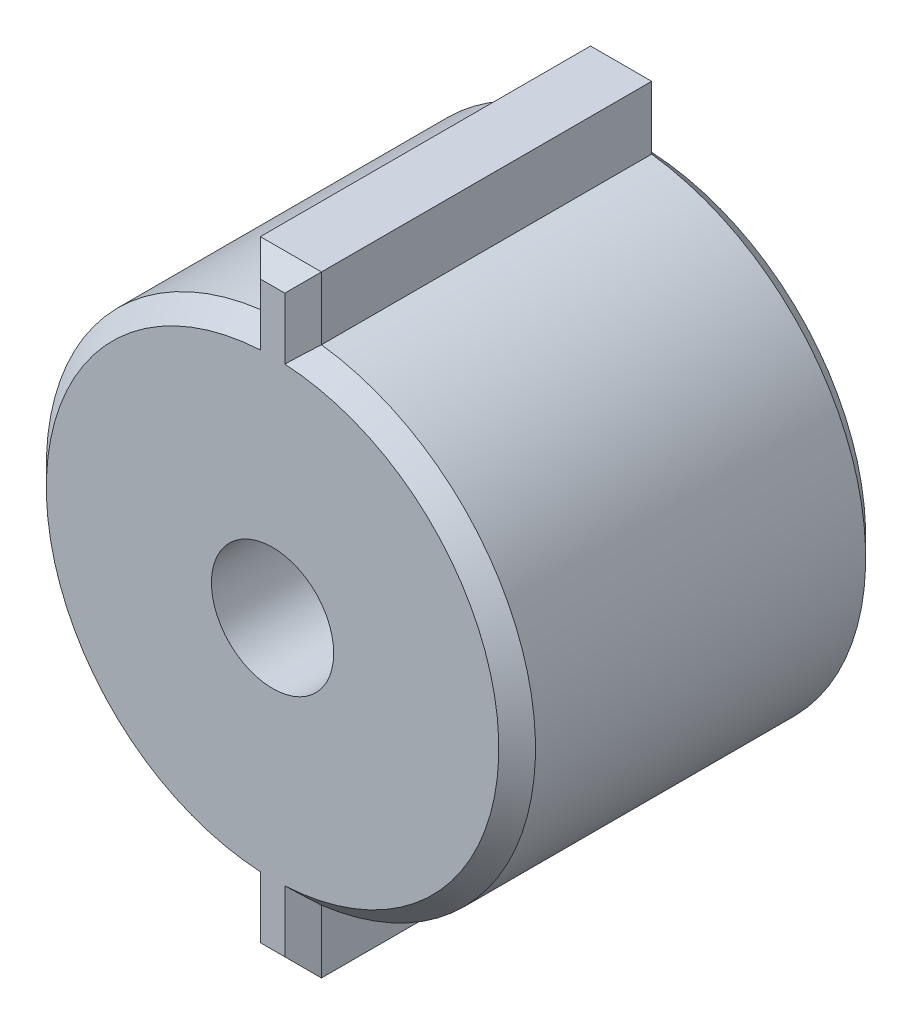
ISO-10303-21;
HEADER;
FILE_DESCRIPTION(('STEP AP214'),'2;1');
FILE_NAME('part.step','',(''),(''),'','','');
FILE_SCHEMA(('AUTOMOTIVE_DESIGN { 1 0 10303 214 1 1 1 1 }'));
ENDSEC;
DATA;
#1=APPLICATION_CONTEXT('core data for automotive mechanical design processes');
#2=APPLICATION_PROTOCOL_DEFINITION('international standard','automotive_design',2000,#1);
#3=PRODUCT_CONTEXT('',#1,'mechanical');
#4=PRODUCT('Part','Part','',(#3));
#5=PRODUCT_RELATED_PRODUCT_CATEGORY('part','',(#4));
#6=PRODUCT_DEFINITION_FORMATION('','',#4);
#7=PRODUCT_DEFINITION_CONTEXT('part definition',#1,'design');
#8=PRODUCT_DEFINITION('design','',#6,#7);
#9=PRODUCT_DEFINITION_SHAPE('','',#8);
#10=(LENGTH_UNIT() NAMED_UNIT(*) SI_UNIT(.MILLI.,.METRE.));
#11=(NAMED_UNIT(*) PLANE_ANGLE_UNIT() SI_UNIT($,.RADIAN.));
#12=(NAMED_UNIT(*) SI_UNIT($,.STERADIAN.) SOLID_ANGLE_UNIT());
#13=UNCERTAINTY_MEASURE_WITH_UNIT(LENGTH_MEASURE(1.E-05),#10,'distance_accuracy_value','');
#14=(GEOMETRIC_REPRESENTATION_CONTEXT(3) GLOBAL_UNCERTAINTY_ASSIGNED_CONTEXT((#13)) GLOBAL_UNIT_ASSIGNED_CONTEXT((#10,
#11,#12)) REPRESENTATION_CONTEXT('',''));
#15=CARTESIAN_POINT('',(0.,0.,0.));
#16=DIRECTION('',(0.,0.,1.));
#17=DIRECTION('',(1.,0.,0.));
#18=AXIS2_PLACEMENT_3D('',#15,#16,#17);
#19=CARTESIAN_POINT('',(0.,0.,1.5));
#20=DIRECTION('',(0.,0.,-1.));
#21=DIRECTION('',(-1.,0.,0.));
#22=AXIS2_PLACEMENT_3D('',#19,#20,#21);
#23=CYLINDRICAL_SURFACE('',#22,2.);
#24=DIRECTION('',(0.,0.,-1.));
#25=VECTOR('',#24,1.);
#26=CARTESIAN_POINT('',(-0.25,1.98431348329844,1.5));
#27=LINE('',#26,#25);
#28=CARTESIAN_POINT('',(-0.25,1.98431348329844,1.35));
#29=VERTEX_POINT('',#28);
#30=CARTESIAN_POINT('',(-0.25,1.98431348329844,-1.35));
#31=VERTEX_POINT('',#30);
#32=EDGE_CURVE('E473',#29,#31,#27,.T.);
#33=ORIENTED_EDGE('',*,*,#32,.T.);
#34=CARTESIAN_POINT('',(0.,0.,-1.35));
#35=DIRECTION('',(0.,0.,1.));
#36=DIRECTION('',(1.,0.,0.));
#37=AXIS2_PLACEMENT_3D('',#34,#35,#36);
#38=CIRCLE('',#37,2.);
#39=CARTESIAN_POINT('',(-0.25,-1.98431348329844,-1.35));
#40=VERTEX_POINT('',#39);
#41=EDGE_CURVE('E214',#31,#40,#38,.T.);
#42=ORIENTED_EDGE('',*,*,#41,.T.);
#43=DIRECTION('',(0.,0.,-1.));
#44=VECTOR('',#43,1.);
#45=CARTESIAN_POINT('',(-0.25,-1.98431348329844,1.5));
#46=LINE('',#45,#44);
#47=CARTESIAN_POINT('',(-0.25,-1.98431348329844,1.35));
#48=VERTEX_POINT('',#47);
#49=EDGE_CURVE('E172',#48,#40,#46,.T.);
#50=ORIENTED_EDGE('',*,*,#49,.F.);
#51=CARTESIAN_POINT('',(0.,0.,1.35));
#52=DIRECTION('',(0.,0.,1.));
#53=DIRECTION('',(1.,0.,0.));
#54=AXIS2_PLACEMENT_3D('',#51,#52,#53);
#55=CIRCLE('',#54,2.);
#56=EDGE_CURVE('E212',#48,#29,#55,.F.);
#57=ORIENTED_EDGE('',*,*,#56,.T.);
#58=EDGE_LOOP('',(#33,#42,#50,#57));
#59=FACE_BOUND('',#58,.T.);
#60=ADVANCED_FACE('F38',(#59),#23,.T.);
#61=CARTESIAN_POINT('',(-0.25,0.,1.5));
#62=DIRECTION('',(-1.,0.,0.));
#63=DIRECTION('',(0.,0.,1.));
#64=AXIS2_PLACEMENT_3D('',#61,#62,#63);
#65=PLANE('',#64);
#66=ORIENTED_EDGE('',*,*,#49,.T.);
#67=DIRECTION('',(0.,-1.,0.));
#68=VECTOR('',#67,1.);
#69=CARTESIAN_POINT('',(-0.25,-2.5,-1.35));
#70=LINE('',#69,#68);
#71=CARTESIAN_POINT('',(-0.25,-2.5,-1.35));
#72=VERTEX_POINT('',#71);
#73=EDGE_CURVE('E159',#40,#72,#70,.T.);
#74=ORIENTED_EDGE('',*,*,#73,.T.);
#75=DIRECTION('',(0.,0.,-1.));
#76=VECTOR('',#75,1.);
#77=CARTESIAN_POINT('',(-0.25,-2.5,1.5));
#78=LINE('',#77,#76);
#79=CARTESIAN_POINT('',(-0.25,-2.5,1.35));
#80=VERTEX_POINT('',#79);
#81=EDGE_CURVE('E414',#80,#72,#78,.T.);
#82=ORIENTED_EDGE('',*,*,#81,.F.);
#83=DIRECTION('',(0.,1.,0.));
#84=VECTOR('',#83,1.);
#85=CARTESIAN_POINT('',(-0.25,0.,1.35));
#86=LINE('',#85,#84);
#87=EDGE_CURVE('E179',#80,#48,#86,.T.);
#88=ORIENTED_EDGE('',*,*,#87,.T.);
#89=EDGE_LOOP('',(#66,#74,#82,#88));
#90=FACE_BOUND('',#89,.T.);
#91=ADVANCED_FACE('F417',(#90),#65,.T.);
#92=CARTESIAN_POINT('',(0.,-2.5,1.5));
#93=DIRECTION('',(0.,-1.,0.));
#94=DIRECTION('',(0.,0.,-1.));
#95=AXIS2_PLACEMENT_3D('',#92,#93,#94);
#96=PLANE('',#95);
#97=ORIENTED_EDGE('',*,*,#81,.T.);
#98=DIRECTION('',(1.,0.,0.));
#99=VECTOR('',#98,1.);
#100=CARTESIAN_POINT('',(0.25,-2.5,-1.35));
#101=LINE('',#100,#99);
#102=CARTESIAN_POINT('',(0.25,-2.5,-1.35));
#103=VERTEX_POINT('',#102);
#104=EDGE_CURVE('E189',#72,#103,#101,.T.);
#105=ORIENTED_EDGE('',*,*,#104,.T.);
#106=DIRECTION('',(0.,0.,-1.));
#107=VECTOR('',#106,1.);
#108=CARTESIAN_POINT('',(0.25,-2.5,1.5));
#109=LINE('',#108,#107);
#110=CARTESIAN_POINT('',(0.25,-2.5,1.35));
#111=VERTEX_POINT('',#110);
#112=EDGE_CURVE('E401',#111,#103,#109,.T.);
#113=ORIENTED_EDGE('',*,*,#112,.F.);
#114=DIRECTION('',(-1.,0.,0.));
#115=VECTOR('',#114,1.);
#116=CARTESIAN_POINT('',(0.,-2.5,1.35));
#117=LINE('',#116,#115);
#118=EDGE_CURVE('E187',#111,#80,#117,.T.);
#119=ORIENTED_EDGE('',*,*,#118,.T.);
#120=EDGE_LOOP('',(#97,#105,#113,#119));
#121=FACE_BOUND('',#120,.T.);
#122=ADVANCED_FACE('F413',(#121),#96,.T.);
#123=CARTESIAN_POINT('',(0.25,0.,1.5));
#124=DIRECTION('',(-1.,0.,0.));
#125=DIRECTION('',(0.,0.,1.));
#126=AXIS2_PLACEMENT_3D('',#123,#124,#125);
#127=PLANE('',#126);
#128=ORIENTED_EDGE('',*,*,#112,.T.);
#129=DIRECTION('',(0.,1.,0.));
#130=VECTOR('',#129,1.);
#131=CARTESIAN_POINT('',(0.25,0.,-1.35));
#132=LINE('',#131,#130);
#133=CARTESIAN_POINT('',(0.25,-1.98431348329844,-1.35));
#134=VERTEX_POINT('',#133);
#135=EDGE_CURVE('E193',#103,#134,#132,.T.);
#136=ORIENTED_EDGE('',*,*,#135,.T.);
#137=DIRECTION('',(0.,0.,-1.));
#138=VECTOR('',#137,1.);
#139=CARTESIAN_POINT('',(0.25,-1.98431348329844,1.5));
#140=LINE('',#139,#138);
#141=CARTESIAN_POINT('',(0.25,-1.98431348329844,1.35));
#142=VERTEX_POINT('',#141);
#143=EDGE_CURVE('E391',#142,#134,#140,.T.);
#144=ORIENTED_EDGE('',*,*,#143,.F.);
#145=DIRECTION('',(0.,-1.,0.));
#146=VECTOR('',#145,1.);
#147=CARTESIAN_POINT('',(0.25,-2.5,1.35));
#148=LINE('',#147,#146);
#149=EDGE_CURVE('E191',#142,#111,#148,.T.);
#150=ORIENTED_EDGE('',*,*,#149,.T.);
#151=EDGE_LOOP('',(#128,#136,#144,#150));
#152=FACE_BOUND('',#151,.T.);
#153=ADVANCED_FACE('F398',(#152),#127,.F.);
#154=CARTESIAN_POINT('',(0.,0.,1.5));
#155=DIRECTION('',(0.,0.,-1.));
#156=DIRECTION('',(-1.,0.,0.));
#157=AXIS2_PLACEMENT_3D('',#154,#155,#156);
#158=CYLINDRICAL_SURFACE('',#157,2.);
#159=ORIENTED_EDGE('',*,*,#143,.T.);
#160=CARTESIAN_POINT('',(0.,0.,-1.35));
#161=DIRECTION('',(0.,0.,1.));
#162=DIRECTION('',(1.,0.,0.));
#163=AXIS2_PLACEMENT_3D('',#160,#161,#162);
#164=CIRCLE('',#163,2.);
#165=CARTESIAN_POINT('',(0.25,1.98431348329844,-1.35));
#166=VERTEX_POINT('',#165);
#167=EDGE_CURVE('E197',#134,#166,#164,.T.);
#168=ORIENTED_EDGE('',*,*,#167,.T.);
#169=DIRECTION('',(0.,0.,-1.));
#170=VECTOR('',#169,1.);
#171=CARTESIAN_POINT('',(0.25,1.98431348329844,1.5));
#172=LINE('',#171,#170);
#173=CARTESIAN_POINT('',(0.25,1.98431348329844,1.35));
#174=VERTEX_POINT('',#173);
#175=EDGE_CURVE('E394',#174,#166,#172,.T.);
#176=ORIENTED_EDGE('',*,*,#175,.F.);
#177=CARTESIAN_POINT('',(0.,0.,1.35));
#178=DIRECTION('',(0.,0.,1.));
#179=DIRECTION('',(1.,0.,0.));
#180=AXIS2_PLACEMENT_3D('',#177,#178,#179);
#181=CIRCLE('',#180,2.);
#182=EDGE_CURVE('E195',#174,#142,#181,.F.);
#183=ORIENTED_EDGE('',*,*,#182,.T.);
#184=EDGE_LOOP('',(#159,#168,#176,#183));
#185=FACE_BOUND('',#184,.T.);
#186=ADVANCED_FACE('F390',(#185),#158,.T.);
#187=CARTESIAN_POINT('',(0.25,0.,1.5));
#188=DIRECTION('',(-1.,0.,0.));
#189=DIRECTION('',(0.,0.,1.));
#190=AXIS2_PLACEMENT_3D('',#187,#188,#189);
#191=PLANE('',#190);
#192=ORIENTED_EDGE('',*,*,#175,.T.);
#193=DIRECTION('',(0.,1.,0.));
#194=VECTOR('',#193,1.);
#195=CARTESIAN_POINT('',(0.25,0.,-1.35));
#196=LINE('',#195,#194);
#197=CARTESIAN_POINT('',(0.25,2.5,-1.35));
#198=VERTEX_POINT('',#197);
#199=EDGE_CURVE('E201',#166,#198,#196,.T.);
#200=ORIENTED_EDGE('',*,*,#199,.T.);
#201=DIRECTION('',(0.,0.,-1.));
#202=VECTOR('',#201,1.);
#203=CARTESIAN_POINT('',(0.25,2.5,1.5));
#204=LINE('',#203,#202);
#205=CARTESIAN_POINT('',(0.25,2.5,1.35));
#206=VERTEX_POINT('',#205);
#207=EDGE_CURVE('E480',#206,#198,#204,.T.);
#208=ORIENTED_EDGE('',*,*,#207,.F.);
#209=DIRECTION('',(0.,-1.,0.));
#210=VECTOR('',#209,1.);
#211=CARTESIAN_POINT('',(0.25,1.98431348329844,1.35));
#212=LINE('',#211,#210);
#213=EDGE_CURVE('E199',#206,#174,#212,.T.);
#214=ORIENTED_EDGE('',*,*,#213,.T.);
#215=EDGE_LOOP('',(#192,#200,#208,#214));
#216=FACE_BOUND('',#215,.T.);
#217=ADVANCED_FACE('F463',(#216),#191,.F.);
#218=CARTESIAN_POINT('',(0.,2.5,1.5));
#219=DIRECTION('',(0.,-1.,0.));
#220=DIRECTION('',(0.,0.,-1.));
#221=AXIS2_PLACEMENT_3D('',#218,#219,#220);
#222=PLANE('',#221);
#223=ORIENTED_EDGE('',*,*,#207,.T.);
#224=DIRECTION('',(-1.,0.,0.));
#225=VECTOR('',#224,1.);
#226=CARTESIAN_POINT('',(0.,2.5,-1.35));
#227=LINE('',#226,#225);
#228=CARTESIAN_POINT('',(-0.25,2.5,-1.35));
#229=VERTEX_POINT('',#228);
#230=EDGE_CURVE('E205',#198,#229,#227,.T.);
#231=ORIENTED_EDGE('',*,*,#230,.T.);
#232=DIRECTION('',(0.,0.,-1.));
#233=VECTOR('',#232,1.);
#234=CARTESIAN_POINT('',(-0.25,2.5,1.5));
#235=LINE('',#234,#233);
#236=CARTESIAN_POINT('',(-0.25,2.5,1.35));
#237=VERTEX_POINT('',#236);
#238=EDGE_CURVE('E477',#237,#229,#235,.T.);
#239=ORIENTED_EDGE('',*,*,#238,.F.);
#240=DIRECTION('',(1.,0.,0.));
#241=VECTOR('',#240,1.);
#242=CARTESIAN_POINT('',(0.25,2.5,1.35));
#243=LINE('',#242,#241);
#244=EDGE_CURVE('E203',#237,#206,#243,.T.);
#245=ORIENTED_EDGE('',*,*,#244,.T.);
#246=EDGE_LOOP('',(#223,#231,#239,#245));
#247=FACE_BOUND('',#246,.T.);
#248=ADVANCED_FACE('F454',(#247),#222,.F.);
#249=CARTESIAN_POINT('',(0.,0.,1.5));
#250=DIRECTION('',(0.,0.,-1.));
#251=DIRECTION('',(-1.,0.,0.));
#252=AXIS2_PLACEMENT_3D('',#249,#250,#251);
#253=CYLINDRICAL_SURFACE('',#252,0.5);
#254=CARTESIAN_POINT('',(0.,0.,1.5));
#255=DIRECTION('',(0.,0.,1.));
#256=DIRECTION('',(1.,0.,0.));
#257=AXIS2_PLACEMENT_3D('',#254,#255,#256);
#258=CIRCLE('',#257,0.5);
#259=CARTESIAN_POINT('',(0.5,0.,1.5));
#260=VERTEX_POINT('',#259);
#261=EDGE_CURVE('E469',#260,#260,#258,.T.);
#262=ORIENTED_EDGE('',*,*,#261,.T.);
#263=EDGE_LOOP('',(#262));
#264=FACE_BOUND('',#263,.T.);
#265=CARTESIAN_POINT('',(0.,0.,-1.5));
#266=DIRECTION('',(0.,0.,1.));
#267=DIRECTION('',(1.,0.,0.));
#268=AXIS2_PLACEMENT_3D('',#265,#266,#267);
#269=CIRCLE('',#268,0.5);
#270=CARTESIAN_POINT('',(0.5,0.,-1.5));
#271=VERTEX_POINT('',#270);
#272=EDGE_CURVE('E295',#271,#271,#269,.T.);
#273=ORIENTED_EDGE('',*,*,#272,.F.);
#274=EDGE_LOOP('',(#273));
#275=FACE_BOUND('',#274,.T.);
#276=ADVANCED_FACE('F451',(#264,#275),#253,.F.);
#277=CARTESIAN_POINT('',(-0.25,0.,1.5));
#278=DIRECTION('',(-1.,0.,0.));
#279=DIRECTION('',(0.,0.,1.));
#280=AXIS2_PLACEMENT_3D('',#277,#278,#279);
#281=PLANE('',#280);
#282=ORIENTED_EDGE('',*,*,#238,.T.);
#283=DIRECTION('',(0.,-1.,0.));
#284=VECTOR('',#283,1.);
#285=CARTESIAN_POINT('',(-0.25,1.98431348329844,-1.35));
#286=LINE('',#285,#284);
#287=EDGE_CURVE('E210',#229,#31,#286,.T.);
#288=ORIENTED_EDGE('',*,*,#287,.T.);
#289=ORIENTED_EDGE('',*,*,#32,.F.);
#290=DIRECTION('',(0.,1.,0.));
#291=VECTOR('',#290,1.);
#292=CARTESIAN_POINT('',(-0.25,0.,1.35));
#293=LINE('',#292,#291);
#294=EDGE_CURVE('E207',#29,#237,#293,.T.);
#295=ORIENTED_EDGE('',*,*,#294,.T.);
#296=EDGE_LOOP('',(#282,#288,#289,#295));
#297=FACE_BOUND('',#296,.T.);
#298=ADVANCED_FACE('F453',(#297),#281,.T.);
#299=CARTESIAN_POINT('',(0.,0.,1.5));
#300=DIRECTION('',(0.,0.,1.));
#301=DIRECTION('',(1.,0.,0.));
#302=AXIS2_PLACEMENT_3D('',#299,#300,#301);
#303=PLANE('',#302);
#304=DIRECTION('',(-1.,0.,0.));
#305=VECTOR('',#304,1.);
#306=CARTESIAN_POINT('',(-0.25,2.35,1.5));
#307=LINE('',#306,#305);
#308=CARTESIAN_POINT('',(0.0999999999999993,2.35,1.5));
#309=VERTEX_POINT('',#308);
#310=CARTESIAN_POINT('',(-0.0999999999999991,2.35,1.5));
#311=VERTEX_POINT('',#310);
#312=EDGE_CURVE('E48',#309,#311,#307,.T.);
#313=ORIENTED_EDGE('',*,*,#312,.T.);
#314=DIRECTION('',(0.,-1.,0.));
#315=VECTOR('',#314,1.);
#316=CARTESIAN_POINT('',(-0.0999999999999991,0.,1.5));
#317=LINE('',#316,#315);
#318=CARTESIAN_POINT('',(-0.0999999999999991,1.84729532019112,1.5));
#319=VERTEX_POINT('',#318);
#320=EDGE_CURVE('E11',#311,#319,#317,.T.);
#321=ORIENTED_EDGE('',*,*,#320,.T.);
#322=CARTESIAN_POINT('',(0.,0.,1.5));
#323=DIRECTION('',(0.,0.,1.));
#324=DIRECTION('',(1.,0.,0.));
#325=AXIS2_PLACEMENT_3D('',#322,#323,#324);
#326=CIRCLE('',#325,1.85);
#327=CARTESIAN_POINT('',(-0.0999999999999991,-1.84729532019112,1.5));
#328=VERTEX_POINT('',#327);
#329=EDGE_CURVE('E216',#319,#328,#326,.T.);
#330=ORIENTED_EDGE('',*,*,#329,.T.);
#331=DIRECTION('',(0.,-1.,0.));
#332=VECTOR('',#331,1.);
#333=CARTESIAN_POINT('',(-0.0999999999999991,0.,1.5));
#334=LINE('',#333,#332);
#335=CARTESIAN_POINT('',(-0.0999999999999991,-2.35,1.5));
#336=VERTEX_POINT('',#335);
#337=EDGE_CURVE('E218',#328,#336,#334,.T.);
#338=ORIENTED_EDGE('',*,*,#337,.T.);
#339=DIRECTION('',(1.,0.,0.));
#340=VECTOR('',#339,1.);
#341=CARTESIAN_POINT('',(0.,-2.35,1.5));
#342=LINE('',#341,#340);
#343=CARTESIAN_POINT('',(0.0999999999999993,-2.35,1.5));
#344=VERTEX_POINT('',#343);
#345=EDGE_CURVE('E220',#336,#344,#342,.T.);
#346=ORIENTED_EDGE('',*,*,#345,.T.);
#347=DIRECTION('',(0.,1.,0.));
#348=VECTOR('',#347,1.);
#349=CARTESIAN_POINT('',(0.0999999999999993,-1.98431348329844,1.5));
#350=LINE('',#349,#348);
#351=CARTESIAN_POINT('',(0.0999999999999993,-1.84729532019112,1.5));
#352=VERTEX_POINT('',#351);
#353=EDGE_CURVE('E222',#344,#352,#350,.T.);
#354=ORIENTED_EDGE('',*,*,#353,.T.);
#355=CARTESIAN_POINT('',(0.,0.,1.5));
#356=DIRECTION('',(0.,0.,1.));
#357=DIRECTION('',(1.,0.,0.));
#358=AXIS2_PLACEMENT_3D('',#355,#356,#357);
#359=CIRCLE('',#358,1.85);
#360=CARTESIAN_POINT('',(0.0999999999999993,1.84729532019112,1.5));
#361=VERTEX_POINT('',#360);
#362=EDGE_CURVE('E224',#352,#361,#359,.T.);
#363=ORIENTED_EDGE('',*,*,#362,.T.);
#364=DIRECTION('',(0.,1.,0.));
#365=VECTOR('',#364,1.);
#366=CARTESIAN_POINT('',(0.0999999999999993,2.5,1.5));
#367=LINE('',#366,#365);
#368=EDGE_CURVE('E59',#361,#309,#367,.T.);
#369=ORIENTED_EDGE('',*,*,#368,.T.);
#370=EDGE_LOOP('',(#313,#321,#330,#338,#346,#354,#363,#369));
#371=FACE_BOUND('',#370,.T.);
#372=ORIENTED_EDGE('',*,*,#261,.F.);
#373=EDGE_LOOP('',(#372));
#374=FACE_BOUND('',#373,.T.);
#375=ADVANCED_FACE('F460',(#371,#374),#303,.T.);
#376=CARTESIAN_POINT('',(0.,0.,-1.5));
#377=DIRECTION('',(0.,0.,1.));
#378=DIRECTION('',(1.,0.,0.));
#379=AXIS2_PLACEMENT_3D('',#376,#377,#378);
#380=PLANE('',#379);
#381=DIRECTION('',(-1.,0.,0.));
#382=VECTOR('',#381,1.);
#383=CARTESIAN_POINT('',(-0.25,-2.35,-1.5));
#384=LINE('',#383,#382);
#385=CARTESIAN_POINT('',(0.0999999999999993,-2.35,-1.5));
#386=VERTEX_POINT('',#385);
#387=CARTESIAN_POINT('',(-0.0999999999999991,-2.35,-1.5));
#388=VERTEX_POINT('',#387);
#389=EDGE_CURVE('E177',#386,#388,#384,.T.);
#390=ORIENTED_EDGE('',*,*,#389,.T.);
#391=DIRECTION('',(0.,1.,0.));
#392=VECTOR('',#391,1.);
#393=CARTESIAN_POINT('',(-0.0999999999999991,-1.98431348329844,-1.5));
#394=LINE('',#393,#392);
#395=CARTESIAN_POINT('',(-0.0999999999999991,-1.84729532019112,-1.5));
#396=VERTEX_POINT('',#395);
#397=EDGE_CURVE('E157',#388,#396,#394,.T.);
#398=ORIENTED_EDGE('',*,*,#397,.T.);
#399=CARTESIAN_POINT('',(0.,0.,-1.5));
#400=DIRECTION('',(0.,0.,1.));
#401=DIRECTION('',(1.,0.,0.));
#402=AXIS2_PLACEMENT_3D('',#399,#400,#401);
#403=CIRCLE('',#402,1.85);
#404=CARTESIAN_POINT('',(-0.0999999999999991,1.84729532019112,-1.5));
#405=VERTEX_POINT('',#404);
#406=EDGE_CURVE('E165',#396,#405,#403,.F.);
#407=ORIENTED_EDGE('',*,*,#406,.T.);
#408=DIRECTION('',(0.,1.,0.));
#409=VECTOR('',#408,1.);
#410=CARTESIAN_POINT('',(-0.0999999999999991,2.5,-1.5));
#411=LINE('',#410,#409);
#412=CARTESIAN_POINT('',(-0.0999999999999991,2.35,-1.5));
#413=VERTEX_POINT('',#412);
#414=EDGE_CURVE('E171',#405,#413,#411,.T.);
#415=ORIENTED_EDGE('',*,*,#414,.T.);
#416=DIRECTION('',(1.,0.,0.));
#417=VECTOR('',#416,1.);
#418=CARTESIAN_POINT('',(0.,2.35,-1.5));
#419=LINE('',#418,#417);
#420=CARTESIAN_POINT('',(0.0999999999999993,2.35,-1.5));
#421=VERTEX_POINT('',#420);
#422=EDGE_CURVE('E424',#413,#421,#419,.T.);
#423=ORIENTED_EDGE('',*,*,#422,.T.);
#424=DIRECTION('',(0.,-1.,0.));
#425=VECTOR('',#424,1.);
#426=CARTESIAN_POINT('',(0.0999999999999993,0.,-1.5));
#427=LINE('',#426,#425);
#428=CARTESIAN_POINT('',(0.0999999999999993,1.84729532019112,-1.5));
#429=VERTEX_POINT('',#428);
#430=EDGE_CURVE('E426',#421,#429,#427,.T.);
#431=ORIENTED_EDGE('',*,*,#430,.T.);
#432=CARTESIAN_POINT('',(0.,0.,-1.5));
#433=DIRECTION('',(0.,0.,1.));
#434=DIRECTION('',(1.,0.,0.));
#435=AXIS2_PLACEMENT_3D('',#432,#433,#434);
#436=CIRCLE('',#435,1.85);
#437=CARTESIAN_POINT('',(0.0999999999999993,-1.84729532019112,-1.5));
#438=VERTEX_POINT('',#437);
#439=EDGE_CURVE('E428',#429,#438,#436,.F.);
#440=ORIENTED_EDGE('',*,*,#439,.T.);
#441=DIRECTION('',(0.,-1.,0.));
#442=VECTOR('',#441,1.);
#443=CARTESIAN_POINT('',(0.0999999999999993,0.,-1.5));
#444=LINE('',#443,#442);
#445=EDGE_CURVE('E182',#438,#386,#444,.T.);
#446=ORIENTED_EDGE('',*,*,#445,.T.);
#447=EDGE_LOOP('',(#390,#398,#407,#415,#423,#431,#440,#446));
#448=FACE_BOUND('',#447,.T.);
#449=ORIENTED_EDGE('',*,*,#272,.T.);
#450=EDGE_LOOP('',(#449));
#451=FACE_BOUND('',#450,.T.);
#452=ADVANCED_FACE('F174',(#448,#451),#380,.F.);
#453=CARTESIAN_POINT('',(0.25,0.,-1.35));
#454=DIRECTION('',(-0.707106781186548,0.,0.707106781186548));
#455=DIRECTION('',(0.,1.,0.));
#456=AXIS2_PLACEMENT_3D('',#453,#454,#455);
#457=PLANE('',#456);
#458=DIRECTION('',(-0.577350269189626,-0.577350269189626,-0.577350269189626));
#459=VECTOR('',#458,1.);
#460=CARTESIAN_POINT('',(0.166666666666667,2.41666666666667,-1.43333333333333));
#461=LINE('',#460,#459);
#462=EDGE_CURVE('E270',#198,#421,#461,.T.);
#463=ORIENTED_EDGE('',*,*,#462,.F.);
#464=ORIENTED_EDGE('',*,*,#199,.F.);
#465=CARTESIAN_POINT('',(0.25,1.98431348329844,-1.35));
#466=CARTESIAN_POINT('',(0.224736929174509,1.96205331471373,-1.37526307082549));
#467=CARTESIAN_POINT('',(0.199605425772592,1.93950508045945,-1.40039457422741));
#468=CARTESIAN_POINT('',(0.14960542441054,1.89383236240588,-1.45039457558946));
#469=CARTESIAN_POINT('',(0.124736927812455,1.87070787562438,-1.47526307218754));
#470=CARTESIAN_POINT('',(0.0999999999999933,1.84729532019113,-1.50000000000001));
#471=B_SPLINE_CURVE_WITH_KNOTS('',3,(#465,#466,#467,#468,#469,#470),.UNSPECIFIED.,.F.,.F.,(4,2,
4),(0.,0.126271414620263,0.252543482850132),.UNSPECIFIED.);
#472=EDGE_CURVE('E288',#429,#166,#471,.F.);
#473=ORIENTED_EDGE('',*,*,#472,.F.);
#474=ORIENTED_EDGE('',*,*,#430,.F.);
#475=EDGE_LOOP('',(#463,#464,#473,#474));
#476=FACE_BOUND('',#475,.T.);
#477=ADVANCED_FACE('F284',(#476),#457,.F.);
#478=CARTESIAN_POINT('',(0.,0.,-1.35));
#479=DIRECTION('',(0.,0.,1.));
#480=DIRECTION('',(1.,0.,0.));
#481=AXIS2_PLACEMENT_3D('',#478,#479,#480);
#482=CONICAL_SURFACE('',#481,2.,0.785398163397448);
#483=ORIENTED_EDGE('',*,*,#472,.T.);
#484=ORIENTED_EDGE('',*,*,#167,.F.);
#485=CARTESIAN_POINT('',(0.25,-1.98431348329844,-1.35));
#486=CARTESIAN_POINT('',(0.224736929174509,-1.96205331471373,-1.37526307082549));
#487=CARTESIAN_POINT('',(0.199605425772592,-1.93950508045945,-1.40039457422741));
#488=CARTESIAN_POINT('',(0.14960542441054,-1.89383236240588,-1.45039457558946));
#489=CARTESIAN_POINT('',(0.124736927812455,-1.87070787562438,-1.47526307218754));
#490=CARTESIAN_POINT('',(0.0999999999999933,-1.84729532019113,-1.50000000000001));
#491=B_SPLINE_CURVE_WITH_KNOTS('',3,(#485,#486,#487,#488,#489,#490),.UNSPECIFIED.,.F.,.F.,(4,2,
4),(0.,0.126271414620263,0.252543482850132),.UNSPECIFIED.);
#492=EDGE_CURVE('E261',#438,#134,#491,.F.);
#493=ORIENTED_EDGE('',*,*,#492,.F.);
#494=ORIENTED_EDGE('',*,*,#439,.F.);
#495=EDGE_LOOP('',(#483,#484,#493,#494));
#496=FACE_BOUND('',#495,.T.);
#497=ADVANCED_FACE('F276',(#496),#482,.T.);
#498=CARTESIAN_POINT('',(0.,2.5,-1.35));
#499=DIRECTION('',(0.,-0.707106781186548,0.707106781186548));
#500=DIRECTION('',(-1.,0.,0.));
#501=AXIS2_PLACEMENT_3D('',#498,#499,#500);
#502=PLANE('',#501);
#503=ORIENTED_EDGE('',*,*,#462,.T.);
#504=ORIENTED_EDGE('',*,*,#422,.F.);
#505=DIRECTION('',(-0.577350269189626,0.577350269189626,0.577350269189626));
#506=VECTOR('',#505,1.);
#507=CARTESIAN_POINT('',(0.683333333333334,1.56666666666667,-2.28333333333333));
#508=LINE('',#507,#506);
#509=EDGE_CURVE('E258',#229,#413,#508,.F.);
#510=ORIENTED_EDGE('',*,*,#509,.F.);
#511=ORIENTED_EDGE('',*,*,#230,.F.);
#512=EDGE_LOOP('',(#503,#504,#510,#511));
#513=FACE_BOUND('',#512,.T.);
#514=ADVANCED_FACE('F283',(#513),#502,.F.);
#515=CARTESIAN_POINT('',(0.25,0.,-1.35));
#516=DIRECTION('',(-0.707106781186548,0.,0.707106781186548));
#517=DIRECTION('',(0.,1.,0.));
#518=AXIS2_PLACEMENT_3D('',#515,#516,#517);
#519=PLANE('',#518);
#520=ORIENTED_EDGE('',*,*,#492,.T.);
#521=ORIENTED_EDGE('',*,*,#135,.F.);
#522=DIRECTION('',(0.577350269189626,-0.577350269189626,0.577350269189626));
#523=VECTOR('',#522,1.);
#524=CARTESIAN_POINT('',(-0.583333333333333,-1.66666666666667,-2.18333333333333));
#525=LINE('',#524,#523);
#526=EDGE_CURVE('E255',#386,#103,#525,.T.);
#527=ORIENTED_EDGE('',*,*,#526,.F.);
#528=ORIENTED_EDGE('',*,*,#445,.F.);
#529=EDGE_LOOP('',(#520,#521,#527,#528));
#530=FACE_BOUND('',#529,.T.);
#531=ADVANCED_FACE('F273',(#530),#519,.F.);
#532=CARTESIAN_POINT('',(-0.0999999999999991,0.,-1.5));
#533=DIRECTION('',(-0.707106781186548,0.,-0.707106781186548));
#534=DIRECTION('',(0.,-1.,0.));
#535=AXIS2_PLACEMENT_3D('',#532,#533,#534);
#536=PLANE('',#535);
#537=ORIENTED_EDGE('',*,*,#509,.T.);
#538=ORIENTED_EDGE('',*,*,#414,.F.);
#539=CARTESIAN_POINT('',(-0.25,1.98431348329844,-1.35));
#540=CARTESIAN_POINT('',(-0.224736929174509,1.96205331471373,-1.37526307082549));
#541=CARTESIAN_POINT('',(-0.199605425772592,1.93950508045945,-1.40039457422741));
#542=CARTESIAN_POINT('',(-0.14960542441054,1.89383236240588,-1.45039457558946));
#543=CARTESIAN_POINT('',(-0.124736927812455,1.87070787562438,-1.47526307218754));
#544=CARTESIAN_POINT('',(-0.099999999999993,1.84729532019113,-1.50000000000001));
#545=B_SPLINE_CURVE_WITH_KNOTS('',3,(#539,#540,#541,#542,#543,#544),.UNSPECIFIED.,.F.,.F.,(4,2,
4),(0.,0.126271414620263,0.252543482850132),.UNSPECIFIED.);
#546=EDGE_CURVE('E168',#31,#405,#545,.T.);
#547=ORIENTED_EDGE('',*,*,#546,.F.);
#548=ORIENTED_EDGE('',*,*,#287,.F.);
#549=EDGE_LOOP('',(#537,#538,#547,#548));
#550=FACE_BOUND('',#549,.T.);
#551=ADVANCED_FACE('F246',(#550),#536,.T.);
#552=CARTESIAN_POINT('',(0.,-2.35,-1.5));
#553=DIRECTION('',(0.,-0.707106781186548,-0.707106781186548));
#554=DIRECTION('',(1.,0.,0.));
#555=AXIS2_PLACEMENT_3D('',#552,#553,#554);
#556=PLANE('',#555);
#557=ORIENTED_EDGE('',*,*,#526,.T.);
#558=ORIENTED_EDGE('',*,*,#104,.F.);
#559=DIRECTION('',(0.577350269189626,0.577350269189626,-0.577350269189626));
#560=VECTOR('',#559,1.);
#561=CARTESIAN_POINT('',(-0.066666666666666,-2.31666666666667,-1.53333333333333));
#562=LINE('',#561,#560);
#563=EDGE_CURVE('E162',#388,#72,#562,.F.);
#564=ORIENTED_EDGE('',*,*,#563,.F.);
#565=ORIENTED_EDGE('',*,*,#389,.F.);
#566=EDGE_LOOP('',(#557,#558,#564,#565));
#567=FACE_BOUND('',#566,.T.);
#568=ADVANCED_FACE('F245',(#567),#556,.T.);
#569=CARTESIAN_POINT('',(0.,0.,-1.35));
#570=DIRECTION('',(0.,0.,1.));
#571=DIRECTION('',(1.,0.,0.));
#572=AXIS2_PLACEMENT_3D('',#569,#570,#571);
#573=CONICAL_SURFACE('',#572,2.,0.785398163397448);
#574=ORIENTED_EDGE('',*,*,#546,.T.);
#575=ORIENTED_EDGE('',*,*,#406,.F.);
#576=CARTESIAN_POINT('',(-0.0999999999999991,-1.84729532019112,-1.5));
#577=CARTESIAN_POINT('',(-0.124736927812461,-1.87070787562437,-1.47526307218754));
#578=CARTESIAN_POINT('',(-0.149605424410544,-1.89383236240587,-1.45039457558946));
#579=CARTESIAN_POINT('',(-0.199605425772587,-1.93950508045946,-1.40039457422741));
#580=CARTESIAN_POINT('',(-0.224736929174499,-1.96205331471375,-1.3752630708255));
#581=CARTESIAN_POINT('',(-0.249999999999982,-1.98431348329848,-1.35000000000002));
#582=B_SPLINE_CURVE_WITH_KNOTS('',3,(#576,#577,#578,#579,#580,#581),.UNSPECIFIED.,.F.,.F.,(4,2,
4),(0.,0.126272068229869,0.252543482850131),.UNSPECIFIED.);
#583=EDGE_CURVE('E153',#40,#396,#582,.F.);
#584=ORIENTED_EDGE('',*,*,#583,.F.);
#585=ORIENTED_EDGE('',*,*,#41,.F.);
#586=EDGE_LOOP('',(#574,#575,#584,#585));
#587=FACE_BOUND('',#586,.T.);
#588=ADVANCED_FACE('F166',(#587),#573,.T.);
#589=CARTESIAN_POINT('',(-0.0999999999999991,0.,-1.5));
#590=DIRECTION('',(-0.707106781186548,0.,-0.707106781186548));
#591=DIRECTION('',(0.,-1.,0.));
#592=AXIS2_PLACEMENT_3D('',#589,#590,#591);
#593=PLANE('',#592);
#594=ORIENTED_EDGE('',*,*,#563,.T.);
#595=ORIENTED_EDGE('',*,*,#73,.F.);
#596=ORIENTED_EDGE('',*,*,#583,.T.);
#597=ORIENTED_EDGE('',*,*,#397,.F.);
#598=EDGE_LOOP('',(#594,#595,#596,#597));
#599=FACE_BOUND('',#598,.T.);
#600=ADVANCED_FACE('F155',(#599),#593,.T.);
#601=CARTESIAN_POINT('',(0.0999999999999993,0.,1.5));
#602=DIRECTION('',(0.70710678118655,0.,0.707106781186545));
#603=DIRECTION('',(0.,-1.,0.));
#604=AXIS2_PLACEMENT_3D('',#601,#602,#603);
#605=PLANE('',#604);
#606=CARTESIAN_POINT('',(0.25,-1.98431348329844,1.35));
#607=CARTESIAN_POINT('',(0.224736929174509,-1.96205331471373,1.37526307082549));
#608=CARTESIAN_POINT('',(0.199605425772592,-1.93950508045945,1.40039457422741));
#609=CARTESIAN_POINT('',(0.14960542441054,-1.89383236240588,1.45039457558946));
#610=CARTESIAN_POINT('',(0.124736927812455,-1.87070787562438,1.47526307218754));
#611=CARTESIAN_POINT('',(0.0999999999999933,-1.84729532019113,1.50000000000001));
#612=B_SPLINE_CURVE_WITH_KNOTS('',3,(#606,#607,#608,#609,#610,#611),.UNSPECIFIED.,.F.,.F.,(4,2,
4),(0.,0.126271414620264,0.252543482850132),.UNSPECIFIED.);
#613=EDGE_CURVE('E369',#352,#142,#612,.F.);
#614=ORIENTED_EDGE('',*,*,#613,.F.);
#615=ORIENTED_EDGE('',*,*,#353,.F.);
#616=DIRECTION('',(0.577350269189625,-0.577350269189625,-0.577350269189628));
#617=VECTOR('',#616,1.);
#618=CARTESIAN_POINT('',(0.166666666666667,-2.41666666666667,1.43333333333333));
#619=LINE('',#618,#617);
#620=EDGE_CURVE('E43',#111,#344,#619,.F.);
#621=ORIENTED_EDGE('',*,*,#620,.F.);
#622=ORIENTED_EDGE('',*,*,#149,.F.);
#623=EDGE_LOOP('',(#614,#615,#621,#622));
#624=FACE_BOUND('',#623,.T.);
#625=ADVANCED_FACE('F366',(#624),#605,.T.);
#626=CARTESIAN_POINT('',(0.,-2.5,1.35));
#627=DIRECTION('',(0.,0.70710678118655,-0.707106781186545));
#628=DIRECTION('',(-1.,0.,0.));
#629=AXIS2_PLACEMENT_3D('',#626,#627,#628);
#630=PLANE('',#629);
#631=ORIENTED_EDGE('',*,*,#620,.T.);
#632=ORIENTED_EDGE('',*,*,#345,.F.);
#633=DIRECTION('',(0.577350269189625,0.577350269189625,0.577350269189628));
#634=VECTOR('',#633,1.);
#635=CARTESIAN_POINT('',(0.58333333333333,-1.66666666666667,2.18333333333333));
#636=LINE('',#635,#634);
#637=EDGE_CURVE('E375',#80,#336,#636,.T.);
#638=ORIENTED_EDGE('',*,*,#637,.F.);
#639=ORIENTED_EDGE('',*,*,#118,.F.);
#640=EDGE_LOOP('',(#631,#632,#638,#639));
#641=FACE_BOUND('',#640,.T.);
#642=ADVANCED_FACE('F41',(#641),#630,.F.);
#643=CARTESIAN_POINT('',(0.,0.,1.5));
#644=DIRECTION('',(0.,0.,-1.));
#645=DIRECTION('',(-1.,0.,0.));
#646=AXIS2_PLACEMENT_3D('',#643,#644,#645);
#647=CONICAL_SURFACE('',#646,1.85,0.785398163397445);
#648=ORIENTED_EDGE('',*,*,#613,.T.);
#649=ORIENTED_EDGE('',*,*,#182,.F.);
#650=CARTESIAN_POINT('',(0.25,1.98431348329844,1.35));
#651=CARTESIAN_POINT('',(0.224736929174509,1.96205331471373,1.37526307082549));
#652=CARTESIAN_POINT('',(0.199605425772592,1.93950508045945,1.40039457422741));
#653=CARTESIAN_POINT('',(0.14960542441054,1.89383236240588,1.45039457558946));
#654=CARTESIAN_POINT('',(0.124736927812455,1.87070787562438,1.47526307218754));
#655=CARTESIAN_POINT('',(0.0999999999999933,1.84729532019113,1.50000000000001));
#656=B_SPLINE_CURVE_WITH_KNOTS('',3,(#650,#651,#652,#653,#654,#655),.UNSPECIFIED.,.F.,.F.,(4,2,
4),(0.,0.126271414620264,0.252543482850133),.UNSPECIFIED.);
#657=EDGE_CURVE('E335',#361,#174,#656,.F.);
#658=ORIENTED_EDGE('',*,*,#657,.F.);
#659=ORIENTED_EDGE('',*,*,#362,.F.);
#660=EDGE_LOOP('',(#648,#649,#658,#659));
#661=FACE_BOUND('',#660,.T.);
#662=ADVANCED_FACE('F352',(#661),#647,.T.);
#663=CARTESIAN_POINT('',(-0.25,0.,1.35));
#664=DIRECTION('',(0.70710678118655,0.,-0.707106781186545));
#665=DIRECTION('',(0.,1.,0.));
#666=AXIS2_PLACEMENT_3D('',#663,#664,#665);
#667=PLANE('',#666);
#668=ORIENTED_EDGE('',*,*,#637,.T.);
#669=ORIENTED_EDGE('',*,*,#337,.F.);
#670=CARTESIAN_POINT('',(-0.25,-1.98431348329844,1.35));
#671=CARTESIAN_POINT('',(-0.224736929174509,-1.96205331471373,1.37526307082549));
#672=CARTESIAN_POINT('',(-0.199605425772592,-1.93950508045945,1.40039457422741));
#673=CARTESIAN_POINT('',(-0.14960542441054,-1.89383236240588,1.45039457558946));
#674=CARTESIAN_POINT('',(-0.124736927812455,-1.87070787562438,1.47526307218754));
#675=CARTESIAN_POINT('',(-0.0999999999999931,-1.84729532019113,1.50000000000001));
#676=B_SPLINE_CURVE_WITH_KNOTS('',3,(#670,#671,#672,#673,#674,#675),.UNSPECIFIED.,.F.,.F.,(4,2,
4),(0.,0.126271414620264,0.252543482850132),.UNSPECIFIED.);
#677=EDGE_CURVE('E327',#48,#328,#676,.T.);
#678=ORIENTED_EDGE('',*,*,#677,.F.);
#679=ORIENTED_EDGE('',*,*,#87,.F.);
#680=EDGE_LOOP('',(#668,#669,#678,#679));
#681=FACE_BOUND('',#680,.T.);
#682=ADVANCED_FACE('F344',(#681),#667,.F.);
#683=CARTESIAN_POINT('',(0.0999999999999993,0.,1.5));
#684=DIRECTION('',(0.70710678118655,0.,0.707106781186545));
#685=DIRECTION('',(0.,-1.,0.));
#686=AXIS2_PLACEMENT_3D('',#683,#684,#685);
#687=PLANE('',#686);
#688=ORIENTED_EDGE('',*,*,#657,.T.);
#689=ORIENTED_EDGE('',*,*,#213,.F.);
#690=DIRECTION('',(-0.577350269189625,-0.577350269189625,0.577350269189628));
#691=VECTOR('',#690,1.);
#692=CARTESIAN_POINT('',(-0.683333333333331,1.56666666666667,2.28333333333333));
#693=LINE('',#692,#691);
#694=EDGE_CURVE('E324',#309,#206,#693,.F.);
#695=ORIENTED_EDGE('',*,*,#694,.F.);
#696=ORIENTED_EDGE('',*,*,#368,.F.);
#697=EDGE_LOOP('',(#688,#689,#695,#696));
#698=FACE_BOUND('',#697,.T.);
#699=ADVANCED_FACE('F351',(#698),#687,.T.);
#700=CARTESIAN_POINT('',(0.,0.,1.5));
#701=DIRECTION('',(0.,0.,-1.));
#702=DIRECTION('',(-1.,0.,0.));
#703=AXIS2_PLACEMENT_3D('',#700,#701,#702);
#704=CONICAL_SURFACE('',#703,1.85,0.785398163397445);
#705=ORIENTED_EDGE('',*,*,#677,.T.);
#706=ORIENTED_EDGE('',*,*,#329,.F.);
#707=CARTESIAN_POINT('',(-0.0999999999999991,1.84729532019112,1.5));
#708=CARTESIAN_POINT('',(-0.124736927812461,1.87070787562437,1.47526307218754));
#709=CARTESIAN_POINT('',(-0.149605424410544,1.89383236240587,1.45039457558945));
#710=CARTESIAN_POINT('',(-0.199605425772587,1.93950508045946,1.40039457422741));
#711=CARTESIAN_POINT('',(-0.224736929174499,1.96205331471375,1.3752630708255));
#712=CARTESIAN_POINT('',(-0.249999999999982,1.98431348329848,1.35000000000002));
#713=B_SPLINE_CURVE_WITH_KNOTS('',3,(#707,#708,#709,#710,#711,#712),.UNSPECIFIED.,.F.,.F.,(4,2,
4),(0.,0.126272068229869,0.252543482850132),.UNSPECIFIED.);
#714=EDGE_CURVE('E318',#29,#319,#713,.F.);
#715=ORIENTED_EDGE('',*,*,#714,.F.);
#716=ORIENTED_EDGE('',*,*,#56,.F.);
#717=EDGE_LOOP('',(#705,#706,#715,#716));
#718=FACE_BOUND('',#717,.T.);
#719=ADVANCED_FACE('F315',(#718),#704,.T.);
#720=CARTESIAN_POINT('',(0.,2.35,1.5));
#721=DIRECTION('',(0.,0.70710678118655,0.707106781186545));
#722=DIRECTION('',(1.,0.,0.));
#723=AXIS2_PLACEMENT_3D('',#720,#721,#722);
#724=PLANE('',#723);
#725=ORIENTED_EDGE('',*,*,#694,.T.);
#726=ORIENTED_EDGE('',*,*,#244,.F.);
#727=DIRECTION('',(-0.577350269189625,0.577350269189625,-0.577350269189628));
#728=VECTOR('',#727,1.);
#729=CARTESIAN_POINT('',(-0.0666666666666662,2.31666666666667,1.53333333333333));
#730=LINE('',#729,#728);
#731=EDGE_CURVE('E296',#311,#237,#730,.T.);
#732=ORIENTED_EDGE('',*,*,#731,.F.);
#733=ORIENTED_EDGE('',*,*,#312,.F.);
#734=EDGE_LOOP('',(#725,#726,#732,#733));
#735=FACE_BOUND('',#734,.T.);
#736=ADVANCED_FACE('F313',(#735),#724,.T.);
#737=CARTESIAN_POINT('',(-0.25,0.,1.35));
#738=DIRECTION('',(0.70710678118655,0.,-0.707106781186545));
#739=DIRECTION('',(0.,1.,0.));
#740=AXIS2_PLACEMENT_3D('',#737,#738,#739);
#741=PLANE('',#740);
#742=ORIENTED_EDGE('',*,*,#714,.T.);
#743=ORIENTED_EDGE('',*,*,#320,.F.);
#744=ORIENTED_EDGE('',*,*,#731,.T.);
#745=ORIENTED_EDGE('',*,*,#294,.F.);
#746=EDGE_LOOP('',(#742,#743,#744,#745));
#747=FACE_BOUND('',#746,.T.);
#748=ADVANCED_FACE('F306',(#747),#741,.F.);
#749=CLOSED_SHELL('',(#60,#91,#122,#153,#186,#217,#248,#276,#298,#375,#452,#477,#497,#514,#531,
#551,#568,#588,#600,#625,#642,#662,#682,#699,#719,#736,#748));
#750=MANIFOLD_SOLID_BREP('B2',#749);
#751=ADVANCED_BREP_SHAPE_REPRESENTATION('',(#18,#750),#14);
#752=SHAPE_DEFINITION_REPRESENTATION(#9,#751);
ENDSEC;
END-ISO-10303-21;
